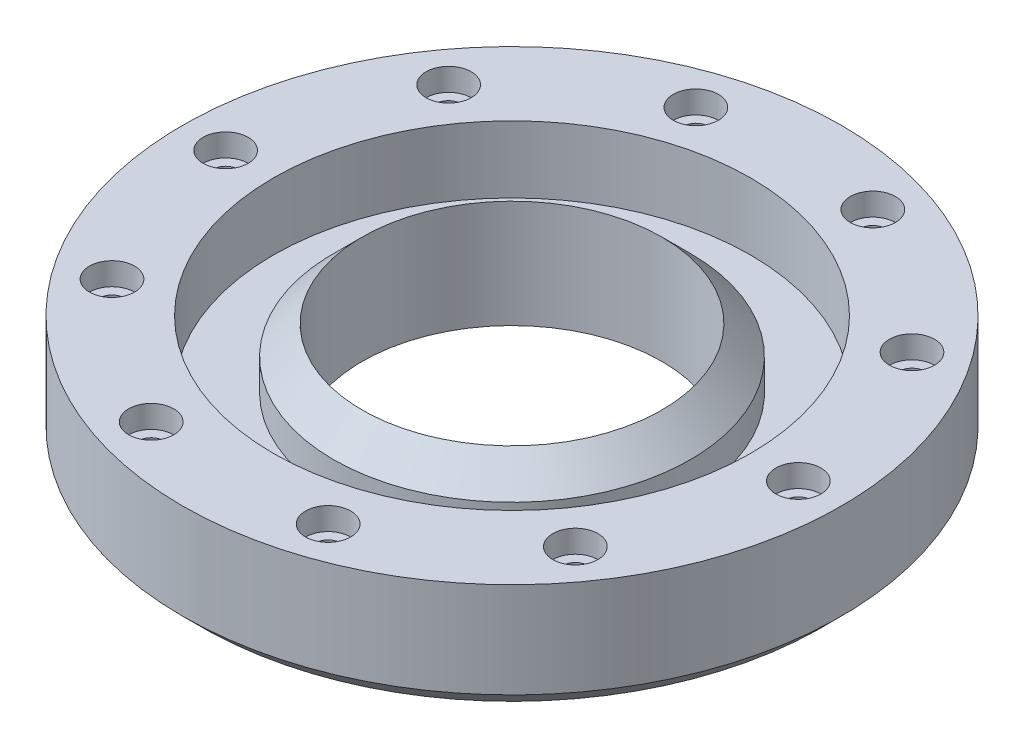
ISO-10303-21;
HEADER;
FILE_DESCRIPTION(('STEP AP214'),'2;1');
FILE_NAME('part.step','',(''),(''),'','','');
FILE_SCHEMA(('AUTOMOTIVE_DESIGN { 1 0 10303 214 1 1 1 1 }'));
ENDSEC;
DATA;
#1=APPLICATION_CONTEXT('core data for automotive mechanical design processes');
#2=APPLICATION_PROTOCOL_DEFINITION('international standard','automotive_design',2000,#1);
#3=PRODUCT_CONTEXT('',#1,'mechanical');
#4=PRODUCT('Part','Part','',(#3));
#5=PRODUCT_RELATED_PRODUCT_CATEGORY('part','',(#4));
#6=PRODUCT_DEFINITION_FORMATION('','',#4);
#7=PRODUCT_DEFINITION_CONTEXT('part definition',#1,'design');
#8=PRODUCT_DEFINITION('design','',#6,#7);
#9=PRODUCT_DEFINITION_SHAPE('','',#8);
#10=(LENGTH_UNIT() NAMED_UNIT(*) SI_UNIT(.MILLI.,.METRE.));
#11=(NAMED_UNIT(*) PLANE_ANGLE_UNIT() SI_UNIT($,.RADIAN.));
#12=(NAMED_UNIT(*) SI_UNIT($,.STERADIAN.) SOLID_ANGLE_UNIT());
#13=UNCERTAINTY_MEASURE_WITH_UNIT(LENGTH_MEASURE(1.E-05),#10,'distance_accuracy_value','');
#14=(GEOMETRIC_REPRESENTATION_CONTEXT(3) GLOBAL_UNCERTAINTY_ASSIGNED_CONTEXT((#13)) GLOBAL_UNIT_ASSIGNED_CONTEXT((#10,
#11,#12)) REPRESENTATION_CONTEXT('',''));
#15=CARTESIAN_POINT('',(0.,0.,0.));
#16=DIRECTION('',(0.,0.,1.));
#17=DIRECTION('',(1.,0.,0.));
#18=AXIS2_PLACEMENT_3D('',#15,#16,#17);
#19=CARTESIAN_POINT('',(0.,0.,0.));
#20=DIRECTION('',(0.,-1.,0.));
#21=DIRECTION('',(0.,0.,-1.));
#22=AXIS2_PLACEMENT_3D('',#19,#20,#21);
#23=CYLINDRICAL_SURFACE('',#22,19.939);
#24=CARTESIAN_POINT('',(0.,0.,0.));
#25=DIRECTION('',(0.,-1.,0.));
#26=DIRECTION('',(0.,0.,-1.));
#27=AXIS2_PLACEMENT_3D('',#24,#25,#26);
#28=CIRCLE('',#27,19.939);
#29=CARTESIAN_POINT('',(0.,0.,-19.939));
#30=VERTEX_POINT('',#29);
#31=EDGE_CURVE('E222',#30,#30,#28,.T.);
#32=ORIENTED_EDGE('',*,*,#31,.T.);
#33=EDGE_LOOP('',(#32));
#34=FACE_BOUND('',#33,.T.);
#35=CARTESIAN_POINT('',(0.,14.33322,0.));
#36=DIRECTION('',(0.,-1.,0.));
#37=DIRECTION('',(0.,0.,-1.));
#38=AXIS2_PLACEMENT_3D('',#35,#36,#37);
#39=CIRCLE('',#38,19.939);
#40=CARTESIAN_POINT('',(0.,14.33322,-19.939));
#41=VERTEX_POINT('',#40);
#42=EDGE_CURVE('E241',#41,#41,#39,.T.);
#43=ORIENTED_EDGE('',*,*,#42,.F.);
#44=EDGE_LOOP('',(#43));
#45=FACE_BOUND('',#44,.T.);
#46=ADVANCED_FACE('F43',(#34,#45),#23,.F.);
#47=CARTESIAN_POINT('',(0.,0.,0.));
#48=DIRECTION('',(0.,-1.,0.));
#49=DIRECTION('',(0.,0.,-1.));
#50=AXIS2_PLACEMENT_3D('',#47,#48,#49);
#51=CYLINDRICAL_SURFACE('',#50,23.749);
#52=CARTESIAN_POINT('',(0.,10.52322,0.));
#53=DIRECTION('',(0.,1.,0.));
#54=DIRECTION('',(0.,0.,1.));
#55=AXIS2_PLACEMENT_3D('',#52,#53,#54);
#56=CIRCLE('',#55,23.749);
#57=CARTESIAN_POINT('',(0.,10.52322,23.749));
#58=VERTEX_POINT('',#57);
#59=EDGE_CURVE('E244',#58,#58,#56,.F.);
#60=ORIENTED_EDGE('',*,*,#59,.T.);
#61=EDGE_LOOP('',(#60));
#62=FACE_BOUND('',#61,.T.);
#63=CARTESIAN_POINT('',(0.,6.35,0.));
#64=DIRECTION('',(0.,-1.,0.));
#65=DIRECTION('',(0.,0.,-1.));
#66=AXIS2_PLACEMENT_3D('',#63,#64,#65);
#67=CIRCLE('',#66,23.749);
#68=CARTESIAN_POINT('',(0.,6.35,-23.749));
#69=VERTEX_POINT('',#68);
#70=EDGE_CURVE('E237',#69,#69,#67,.T.);
#71=ORIENTED_EDGE('',*,*,#70,.F.);
#72=EDGE_LOOP('',(#71));
#73=FACE_BOUND('',#72,.T.);
#74=ADVANCED_FACE('F262',(#62,#73),#51,.T.);
#75=CARTESIAN_POINT('',(23.749,6.35,0.));
#76=DIRECTION('',(0.,1.,0.));
#77=DIRECTION('',(0.,0.,1.));
#78=AXIS2_PLACEMENT_3D('',#75,#76,#77);
#79=PLANE('',#78);
#80=ORIENTED_EDGE('',*,*,#70,.T.);
#81=EDGE_LOOP('',(#80));
#82=FACE_BOUND('',#81,.T.);
#83=CARTESIAN_POINT('',(0.,6.35,0.));
#84=DIRECTION('',(0.,-1.,0.));
#85=DIRECTION('',(0.,0.,-1.));
#86=AXIS2_PLACEMENT_3D('',#83,#84,#85);
#87=CIRCLE('',#86,31.75);
#88=CARTESIAN_POINT('',(0.,6.35,-31.75));
#89=VERTEX_POINT('',#88);
#90=EDGE_CURVE('E233',#89,#89,#87,.T.);
#91=ORIENTED_EDGE('',*,*,#90,.F.);
#92=EDGE_LOOP('',(#91));
#93=FACE_BOUND('',#92,.T.);
#94=ADVANCED_FACE('F268',(#82,#93),#79,.T.);
#95=CARTESIAN_POINT('',(0.,0.,0.));
#96=DIRECTION('',(0.,-1.,0.));
#97=DIRECTION('',(0.,0.,-1.));
#98=AXIS2_PLACEMENT_3D('',#95,#96,#97);
#99=CYLINDRICAL_SURFACE('',#98,31.75);
#100=ORIENTED_EDGE('',*,*,#90,.T.);
#101=EDGE_LOOP('',(#100));
#102=FACE_BOUND('',#101,.T.);
#103=CARTESIAN_POINT('',(0.,15.24,0.));
#104=DIRECTION('',(0.,-1.,0.));
#105=DIRECTION('',(0.,0.,-1.));
#106=AXIS2_PLACEMENT_3D('',#103,#104,#105);
#107=CIRCLE('',#106,31.75);
#108=CARTESIAN_POINT('',(0.,15.24,-31.75));
#109=VERTEX_POINT('',#108);
#110=EDGE_CURVE('E229',#109,#109,#107,.T.);
#111=ORIENTED_EDGE('',*,*,#110,.F.);
#112=EDGE_LOOP('',(#111));
#113=FACE_BOUND('',#112,.T.);
#114=ADVANCED_FACE('F294',(#102,#113),#99,.F.);
#115=CARTESIAN_POINT('',(31.75,15.24,0.));
#116=DIRECTION('',(0.,1.,0.));
#117=DIRECTION('',(0.,0.,1.));
#118=AXIS2_PLACEMENT_3D('',#115,#116,#117);
#119=PLANE('',#118);
#120=CARTESIAN_POINT('',(30.8235474856858,15.24,-22.3946181123428));
#121=DIRECTION('',(0.,1.,0.));
#122=DIRECTION('',(0.,0.,1.));
#123=AXIS2_PLACEMENT_3D('',#120,#121,#122);
#124=CIRCLE('',#123,3.00000000000002);
#125=CARTESIAN_POINT('',(30.8235474856858,15.24,-19.3946181123428));
#126=VERTEX_POINT('',#125);
#127=EDGE_CURVE('E152',#126,#126,#124,.T.);
#128=ORIENTED_EDGE('',*,*,#127,.F.);
#129=EDGE_LOOP('',(#128));
#130=FACE_BOUND('',#129,.T.);
#131=CARTESIAN_POINT('',(11.7735474856859,15.24,-36.2352532708452));
#132=DIRECTION('',(0.,1.,0.));
#133=DIRECTION('',(0.,0.,1.));
#134=AXIS2_PLACEMENT_3D('',#131,#132,#133);
#135=CIRCLE('',#134,3.00000000000001);
#136=CARTESIAN_POINT('',(11.7735474856859,15.24,-33.2352532708452));
#137=VERTEX_POINT('',#136);
#138=EDGE_CURVE('E158',#137,#137,#135,.T.);
#139=ORIENTED_EDGE('',*,*,#138,.F.);
#140=EDGE_LOOP('',(#139));
#141=FACE_BOUND('',#140,.T.);
#142=CARTESIAN_POINT('',(-11.7735474856851,15.24,-36.2352532708455));
#143=DIRECTION('',(0.,1.,0.));
#144=DIRECTION('',(0.,0.,1.));
#145=AXIS2_PLACEMENT_3D('',#142,#143,#144);
#146=CIRCLE('',#145,3.00000000000001);
#147=CARTESIAN_POINT('',(-11.7735474856851,15.24,-33.2352532708454));
#148=VERTEX_POINT('',#147);
#149=EDGE_CURVE('E164',#148,#148,#146,.T.);
#150=ORIENTED_EDGE('',*,*,#149,.F.);
#151=EDGE_LOOP('',(#150));
#152=FACE_BOUND('',#151,.T.);
#153=CARTESIAN_POINT('',(-30.8235474856853,15.24,-22.3946181123435));
#154=DIRECTION('',(0.,1.,0.));
#155=DIRECTION('',(0.,0.,1.));
#156=AXIS2_PLACEMENT_3D('',#153,#154,#155);
#157=CIRCLE('',#156,3.00000000000001);
#158=CARTESIAN_POINT('',(-30.8235474856853,15.24,-19.3946181123435));
#159=VERTEX_POINT('',#158);
#160=EDGE_CURVE('E170',#159,#159,#157,.T.);
#161=ORIENTED_EDGE('',*,*,#160,.F.);
#162=EDGE_LOOP('',(#161));
#163=FACE_BOUND('',#162,.T.);
#164=CARTESIAN_POINT('',(-38.1,15.24,0.));
#165=DIRECTION('',(0.,1.,0.));
#166=DIRECTION('',(0.,0.,1.));
#167=AXIS2_PLACEMENT_3D('',#164,#165,#166);
#168=CIRCLE('',#167,3.00000000000001);
#169=CARTESIAN_POINT('',(-38.1,15.24,3.00000000000001));
#170=VERTEX_POINT('',#169);
#171=EDGE_CURVE('E176',#170,#170,#168,.T.);
#172=ORIENTED_EDGE('',*,*,#171,.F.);
#173=EDGE_LOOP('',(#172));
#174=FACE_BOUND('',#173,.T.);
#175=CARTESIAN_POINT('',(-30.8235474856856,15.24,22.3946181123431));
#176=DIRECTION('',(0.,1.,0.));
#177=DIRECTION('',(0.,0.,1.));
#178=AXIS2_PLACEMENT_3D('',#175,#176,#177);
#179=CIRCLE('',#178,3.00000000000001);
#180=CARTESIAN_POINT('',(-30.8235474856856,15.24,25.3946181123431));
#181=VERTEX_POINT('',#180);
#182=EDGE_CURVE('E184',#181,#181,#179,.T.);
#183=ORIENTED_EDGE('',*,*,#182,.F.);
#184=EDGE_LOOP('',(#183));
#185=FACE_BOUND('',#184,.T.);
#186=CARTESIAN_POINT('',(-11.7735474856857,15.24,36.2352532708453));
#187=DIRECTION('',(0.,1.,0.));
#188=DIRECTION('',(0.,0.,1.));
#189=AXIS2_PLACEMENT_3D('',#186,#187,#188);
#190=CIRCLE('',#189,3.00000000000001);
#191=CARTESIAN_POINT('',(-11.7735474856857,15.24,39.2352532708453));
#192=VERTEX_POINT('',#191);
#193=EDGE_CURVE('E192',#192,#192,#190,.T.);
#194=ORIENTED_EDGE('',*,*,#193,.F.);
#195=EDGE_LOOP('',(#194));
#196=FACE_BOUND('',#195,.T.);
#197=CARTESIAN_POINT('',(11.7735474856854,15.24,36.2352532708454));
#198=DIRECTION('',(0.,1.,0.));
#199=DIRECTION('',(0.,0.,1.));
#200=AXIS2_PLACEMENT_3D('',#197,#198,#199);
#201=CIRCLE('',#200,3.00000000000001);
#202=CARTESIAN_POINT('',(11.7735474856854,15.24,39.2352532708454));
#203=VERTEX_POINT('',#202);
#204=EDGE_CURVE('E198',#203,#203,#201,.T.);
#205=ORIENTED_EDGE('',*,*,#204,.F.);
#206=EDGE_LOOP('',(#205));
#207=FACE_BOUND('',#206,.T.);
#208=CARTESIAN_POINT('',(30.8235474856855,15.24,22.3946181123433));
#209=DIRECTION('',(0.,1.,0.));
#210=DIRECTION('',(0.,0.,1.));
#211=AXIS2_PLACEMENT_3D('',#208,#209,#210);
#212=CIRCLE('',#211,3.00000000000001);
#213=CARTESIAN_POINT('',(30.8235474856855,15.24,25.3946181123433));
#214=VERTEX_POINT('',#213);
#215=EDGE_CURVE('E204',#214,#214,#212,.T.);
#216=ORIENTED_EDGE('',*,*,#215,.F.);
#217=EDGE_LOOP('',(#216));
#218=FACE_BOUND('',#217,.T.);
#219=CARTESIAN_POINT('',(38.1,15.24,0.));
#220=DIRECTION('',(0.,1.,0.));
#221=DIRECTION('',(0.,0.,1.));
#222=AXIS2_PLACEMENT_3D('',#219,#220,#221);
#223=CIRCLE('',#222,3.00000000000001);
#224=CARTESIAN_POINT('',(38.1,15.24,3.00000000000001));
#225=VERTEX_POINT('',#224);
#226=EDGE_CURVE('E216',#225,#225,#223,.T.);
#227=ORIENTED_EDGE('',*,*,#226,.F.);
#228=EDGE_LOOP('',(#227));
#229=FACE_BOUND('',#228,.T.);
#230=ORIENTED_EDGE('',*,*,#110,.T.);
#231=EDGE_LOOP('',(#230));
#232=FACE_BOUND('',#231,.T.);
#233=CARTESIAN_POINT('',(0.,15.24,0.));
#234=DIRECTION('',(0.,-1.,0.));
#235=DIRECTION('',(0.,0.,-1.));
#236=AXIS2_PLACEMENT_3D('',#233,#234,#235);
#237=CIRCLE('',#236,43.84802);
#238=CARTESIAN_POINT('',(0.,15.24,-43.84802));
#239=VERTEX_POINT('',#238);
#240=EDGE_CURVE('E225',#239,#239,#237,.T.);
#241=ORIENTED_EDGE('',*,*,#240,.F.);
#242=EDGE_LOOP('',(#241));
#243=FACE_BOUND('',#242,.T.);
#244=ADVANCED_FACE('F299',(#130,#141,#152,#163,#174,#185,#196,#207,#218,#229,#232,#243),#119,.T.);
#245=CARTESIAN_POINT('',(0.,0.,0.));
#246=DIRECTION('',(0.,-1.,0.));
#247=DIRECTION('',(0.,0.,-1.));
#248=AXIS2_PLACEMENT_3D('',#245,#246,#247);
#249=CYLINDRICAL_SURFACE('',#248,43.84802);
#250=CARTESIAN_POINT('',(0.,2.54000000000001,0.));
#251=DIRECTION('',(0.,-1.,0.));
#252=DIRECTION('',(0.,0.,-1.));
#253=AXIS2_PLACEMENT_3D('',#250,#251,#252);
#254=CIRCLE('',#253,43.84802);
#255=CARTESIAN_POINT('',(0.,2.54000000000001,-43.84802));
#256=VERTEX_POINT('',#255);
#257=EDGE_CURVE('E11',#256,#256,#254,.F.);
#258=ORIENTED_EDGE('',*,*,#257,.T.);
#259=EDGE_LOOP('',(#258));
#260=FACE_BOUND('',#259,.T.);
#261=ORIENTED_EDGE('',*,*,#240,.T.);
#262=EDGE_LOOP('',(#261));
#263=FACE_BOUND('',#262,.T.);
#264=ADVANCED_FACE('F284',(#260,#263),#249,.T.);
#265=CARTESIAN_POINT('',(19.939,0.,0.));
#266=DIRECTION('',(0.,-1.,0.));
#267=DIRECTION('',(0.,0.,-1.));
#268=AXIS2_PLACEMENT_3D('',#265,#266,#267);
#269=PLANE('',#268);
#270=CARTESIAN_POINT('',(0.,0.,0.));
#271=DIRECTION('',(0.,-1.,0.));
#272=DIRECTION('',(0.,0.,-1.));
#273=AXIS2_PLACEMENT_3D('',#270,#271,#272);
#274=CIRCLE('',#273,41.30802);
#275=CARTESIAN_POINT('',(0.,0.,-41.30802));
#276=VERTEX_POINT('',#275);
#277=EDGE_CURVE('E52',#276,#276,#274,.T.);
#278=ORIENTED_EDGE('',*,*,#277,.T.);
#279=EDGE_LOOP('',(#278));
#280=FACE_BOUND('',#279,.T.);
#281=ORIENTED_EDGE('',*,*,#31,.F.);
#282=EDGE_LOOP('',(#281));
#283=FACE_BOUND('',#282,.T.);
#284=ADVANCED_FACE('F251',(#280,#283),#269,.T.);
#285=CARTESIAN_POINT('',(0.,10.52322,0.));
#286=DIRECTION('',(0.,-1.,0.));
#287=DIRECTION('',(0.,0.,-1.));
#288=AXIS2_PLACEMENT_3D('',#285,#286,#287);
#289=CONICAL_SURFACE('',#288,23.749,0.785398163397451);
#290=ORIENTED_EDGE('',*,*,#42,.T.);
#291=EDGE_LOOP('',(#290));
#292=FACE_BOUND('',#291,.T.);
#293=ORIENTED_EDGE('',*,*,#59,.F.);
#294=EDGE_LOOP('',(#293));
#295=FACE_BOUND('',#294,.T.);
#296=ADVANCED_FACE('F273',(#292,#295),#289,.T.);
#297=CARTESIAN_POINT('',(38.1,12.24,0.));
#298=DIRECTION('',(0.,-1.,0.));
#299=DIRECTION('',(0.,0.,-1.));
#300=AXIS2_PLACEMENT_3D('',#297,#298,#299);
#301=PLANE('',#300);
#302=CARTESIAN_POINT('',(38.1,12.24,0.));
#303=DIRECTION('',(0.,1.,0.));
#304=DIRECTION('',(0.,0.,1.));
#305=AXIS2_PLACEMENT_3D('',#302,#303,#304);
#306=CIRCLE('',#305,1.65);
#307=CARTESIAN_POINT('',(38.1,12.24,1.65));
#308=VERTEX_POINT('',#307);
#309=EDGE_CURVE('E210',#308,#308,#306,.T.);
#310=ORIENTED_EDGE('',*,*,#309,.F.);
#311=EDGE_LOOP('',(#310));
#312=FACE_BOUND('',#311,.T.);
#313=CARTESIAN_POINT('',(38.1,12.24,0.));
#314=DIRECTION('',(0.,1.,0.));
#315=DIRECTION('',(0.,0.,1.));
#316=AXIS2_PLACEMENT_3D('',#313,#314,#315);
#317=CIRCLE('',#316,3.00000000000002);
#318=CARTESIAN_POINT('',(38.1,12.24,3.00000000000002));
#319=VERTEX_POINT('',#318);
#320=EDGE_CURVE('E219',#319,#319,#317,.T.);
#321=ORIENTED_EDGE('',*,*,#320,.T.);
#322=EDGE_LOOP('',(#321));
#323=FACE_BOUND('',#322,.T.);
#324=ADVANCED_FACE('F275',(#312,#323),#301,.F.);
#325=CARTESIAN_POINT('',(38.1,15.24,0.));
#326=DIRECTION('',(0.,1.,0.));
#327=DIRECTION('',(0.,0.,1.));
#328=AXIS2_PLACEMENT_3D('',#325,#326,#327);
#329=CYLINDRICAL_SURFACE('',#328,3.00000000000001);
#330=ORIENTED_EDGE('',*,*,#320,.F.);
#331=EDGE_LOOP('',(#330));
#332=FACE_BOUND('',#331,.T.);
#333=ORIENTED_EDGE('',*,*,#226,.T.);
#334=EDGE_LOOP('',(#333));
#335=FACE_BOUND('',#334,.T.);
#336=ADVANCED_FACE('F281',(#332,#335),#329,.F.);
#337=CARTESIAN_POINT('',(38.1,4.2399906,0.));
#338=DIRECTION('',(0.,1.,0.));
#339=DIRECTION('',(0.,0.,1.));
#340=AXIS2_PLACEMENT_3D('',#337,#338,#339);
#341=CONICAL_SURFACE('',#340,1.65,1.02974425867665);
#342=CARTESIAN_POINT('',(38.1,3.24857057860452,0.));
#343=VERTEX_POINT('',#342);
#344=VERTEX_LOOP('',#343);
#345=FACE_BOUND('',#344,.T.);
#346=CARTESIAN_POINT('',(38.1,4.2399906,0.));
#347=DIRECTION('',(0.,1.,0.));
#348=DIRECTION('',(0.,0.,1.));
#349=AXIS2_PLACEMENT_3D('',#346,#347,#348);
#350=CIRCLE('',#349,1.65);
#351=CARTESIAN_POINT('',(38.1,4.2399906,1.65));
#352=VERTEX_POINT('',#351);
#353=EDGE_CURVE('E213',#352,#352,#350,.T.);
#354=ORIENTED_EDGE('',*,*,#353,.T.);
#355=EDGE_LOOP('',(#354));
#356=FACE_BOUND('',#355,.T.);
#357=ADVANCED_FACE('F317',(#345,#356),#341,.F.);
#358=CARTESIAN_POINT('',(38.1,12.24,0.));
#359=DIRECTION('',(0.,1.,0.));
#360=DIRECTION('',(0.,0.,1.));
#361=AXIS2_PLACEMENT_3D('',#358,#359,#360);
#362=CYLINDRICAL_SURFACE('',#361,1.65);
#363=ORIENTED_EDGE('',*,*,#353,.F.);
#364=EDGE_LOOP('',(#363));
#365=FACE_BOUND('',#364,.T.);
#366=ORIENTED_EDGE('',*,*,#309,.T.);
#367=EDGE_LOOP('',(#366));
#368=FACE_BOUND('',#367,.T.);
#369=ADVANCED_FACE('F321',(#365,#368),#362,.F.);
#370=CARTESIAN_POINT('',(30.8235474856855,12.24,22.3946181123433));
#371=DIRECTION('',(0.,-1.,0.));
#372=DIRECTION('',(0.,0.,-1.));
#373=AXIS2_PLACEMENT_3D('',#370,#371,#372);
#374=PLANE('',#373);
#375=CARTESIAN_POINT('',(30.8235474856855,12.24,22.3946181123433));
#376=DIRECTION('',(0.,1.,0.));
#377=DIRECTION('',(0.,0.,1.));
#378=AXIS2_PLACEMENT_3D('',#375,#376,#377);
#379=CIRCLE('',#378,1.65);
#380=CARTESIAN_POINT('',(30.8235474856855,12.24,24.0446181123433));
#381=VERTEX_POINT('',#380);
#382=EDGE_CURVE('E146',#381,#381,#379,.T.);
#383=ORIENTED_EDGE('',*,*,#382,.F.);
#384=EDGE_LOOP('',(#383));
#385=FACE_BOUND('',#384,.T.);
#386=CARTESIAN_POINT('',(30.8235474856855,12.24,22.3946181123433));
#387=DIRECTION('',(0.,1.,0.));
#388=DIRECTION('',(0.,0.,1.));
#389=AXIS2_PLACEMENT_3D('',#386,#387,#388);
#390=CIRCLE('',#389,3.00000000000001);
#391=CARTESIAN_POINT('',(30.8235474856855,12.24,25.3946181123433));
#392=VERTEX_POINT('',#391);
#393=EDGE_CURVE('E207',#392,#392,#390,.T.);
#394=ORIENTED_EDGE('',*,*,#393,.T.);
#395=EDGE_LOOP('',(#394));
#396=FACE_BOUND('',#395,.T.);
#397=ADVANCED_FACE('F324',(#385,#396),#374,.F.);
#398=CARTESIAN_POINT('',(30.8235474856855,15.24,22.3946181123433));
#399=DIRECTION('',(0.,1.,0.));
#400=DIRECTION('',(0.,0.,1.));
#401=AXIS2_PLACEMENT_3D('',#398,#399,#400);
#402=CYLINDRICAL_SURFACE('',#401,3.00000000000001);
#403=ORIENTED_EDGE('',*,*,#393,.F.);
#404=EDGE_LOOP('',(#403));
#405=FACE_BOUND('',#404,.T.);
#406=ORIENTED_EDGE('',*,*,#215,.T.);
#407=EDGE_LOOP('',(#406));
#408=FACE_BOUND('',#407,.T.);
#409=ADVANCED_FACE('F328',(#405,#408),#402,.F.);
#410=CARTESIAN_POINT('',(11.7735474856854,12.24,36.2352532708454));
#411=DIRECTION('',(0.,-1.,0.));
#412=DIRECTION('',(0.,0.,-1.));
#413=AXIS2_PLACEMENT_3D('',#410,#411,#412);
#414=PLANE('',#413);
#415=CARTESIAN_POINT('',(11.7735474856854,12.24,36.2352532708454));
#416=DIRECTION('',(0.,1.,0.));
#417=DIRECTION('',(0.,0.,1.));
#418=AXIS2_PLACEMENT_3D('',#415,#416,#417);
#419=CIRCLE('',#418,1.65);
#420=CARTESIAN_POINT('',(11.7735474856854,12.24,37.8852532708454));
#421=VERTEX_POINT('',#420);
#422=EDGE_CURVE('E140',#421,#421,#419,.T.);
#423=ORIENTED_EDGE('',*,*,#422,.F.);
#424=EDGE_LOOP('',(#423));
#425=FACE_BOUND('',#424,.T.);
#426=CARTESIAN_POINT('',(11.7735474856854,12.24,36.2352532708454));
#427=DIRECTION('',(0.,1.,0.));
#428=DIRECTION('',(0.,0.,1.));
#429=AXIS2_PLACEMENT_3D('',#426,#427,#428);
#430=CIRCLE('',#429,3.00000000000001);
#431=CARTESIAN_POINT('',(11.7735474856854,12.24,39.2352532708454));
#432=VERTEX_POINT('',#431);
#433=EDGE_CURVE('E201',#432,#432,#430,.T.);
#434=ORIENTED_EDGE('',*,*,#433,.T.);
#435=EDGE_LOOP('',(#434));
#436=FACE_BOUND('',#435,.T.);
#437=ADVANCED_FACE('F332',(#425,#436),#414,.F.);
#438=CARTESIAN_POINT('',(11.7735474856854,15.24,36.2352532708454));
#439=DIRECTION('',(0.,1.,0.));
#440=DIRECTION('',(0.,0.,1.));
#441=AXIS2_PLACEMENT_3D('',#438,#439,#440);
#442=CYLINDRICAL_SURFACE('',#441,3.00000000000001);
#443=ORIENTED_EDGE('',*,*,#433,.F.);
#444=EDGE_LOOP('',(#443));
#445=FACE_BOUND('',#444,.T.);
#446=ORIENTED_EDGE('',*,*,#204,.T.);
#447=EDGE_LOOP('',(#446));
#448=FACE_BOUND('',#447,.T.);
#449=ADVANCED_FACE('F336',(#445,#448),#442,.F.);
#450=CARTESIAN_POINT('',(-11.7735474856857,12.24,36.2352532708453));
#451=DIRECTION('',(0.,-1.,0.));
#452=DIRECTION('',(0.,0.,-1.));
#453=AXIS2_PLACEMENT_3D('',#450,#451,#452);
#454=PLANE('',#453);
#455=CARTESIAN_POINT('',(-11.7735474856857,12.24,36.2352532708453));
#456=DIRECTION('',(0.,1.,0.));
#457=DIRECTION('',(0.,0.,1.));
#458=AXIS2_PLACEMENT_3D('',#455,#456,#457);
#459=CIRCLE('',#458,1.65);
#460=CARTESIAN_POINT('',(-11.7735474856857,12.24,37.8852532708453));
#461=VERTEX_POINT('',#460);
#462=EDGE_CURVE('E134',#461,#461,#459,.T.);
#463=ORIENTED_EDGE('',*,*,#462,.F.);
#464=EDGE_LOOP('',(#463));
#465=FACE_BOUND('',#464,.T.);
#466=CARTESIAN_POINT('',(-11.7735474856857,12.24,36.2352532708453));
#467=DIRECTION('',(0.,1.,0.));
#468=DIRECTION('',(0.,0.,1.));
#469=AXIS2_PLACEMENT_3D('',#466,#467,#468);
#470=CIRCLE('',#469,3.00000000000001);
#471=CARTESIAN_POINT('',(-11.7735474856857,12.24,39.2352532708453));
#472=VERTEX_POINT('',#471);
#473=EDGE_CURVE('E195',#472,#472,#470,.T.);
#474=ORIENTED_EDGE('',*,*,#473,.T.);
#475=EDGE_LOOP('',(#474));
#476=FACE_BOUND('',#475,.T.);
#477=ADVANCED_FACE('F340',(#465,#476),#454,.F.);
#478=CARTESIAN_POINT('',(-11.7735474856857,15.24,36.2352532708453));
#479=DIRECTION('',(0.,1.,0.));
#480=DIRECTION('',(0.,0.,1.));
#481=AXIS2_PLACEMENT_3D('',#478,#479,#480);
#482=CYLINDRICAL_SURFACE('',#481,3.00000000000001);
#483=ORIENTED_EDGE('',*,*,#473,.F.);
#484=EDGE_LOOP('',(#483));
#485=FACE_BOUND('',#484,.T.);
#486=ORIENTED_EDGE('',*,*,#193,.T.);
#487=EDGE_LOOP('',(#486));
#488=FACE_BOUND('',#487,.T.);
#489=ADVANCED_FACE('F344',(#485,#488),#482,.F.);
#490=CARTESIAN_POINT('',(-30.8235474856856,12.24,22.3946181123431));
#491=DIRECTION('',(0.,-1.,0.));
#492=DIRECTION('',(0.,0.,-1.));
#493=AXIS2_PLACEMENT_3D('',#490,#491,#492);
#494=PLANE('',#493);
#495=CARTESIAN_POINT('',(-30.8235474856856,12.24,22.3946181123431));
#496=DIRECTION('',(0.,1.,0.));
#497=DIRECTION('',(0.,0.,1.));
#498=AXIS2_PLACEMENT_3D('',#495,#496,#497);
#499=CIRCLE('',#498,1.65);
#500=CARTESIAN_POINT('',(-30.8235474856856,12.24,24.0446181123431));
#501=VERTEX_POINT('',#500);
#502=EDGE_CURVE('E127',#501,#501,#499,.T.);
#503=ORIENTED_EDGE('',*,*,#502,.F.);
#504=EDGE_LOOP('',(#503));
#505=FACE_BOUND('',#504,.T.);
#506=CARTESIAN_POINT('',(-30.8235474856856,12.24,22.3946181123431));
#507=DIRECTION('',(0.,1.,0.));
#508=DIRECTION('',(0.,0.,1.));
#509=AXIS2_PLACEMENT_3D('',#506,#507,#508);
#510=CIRCLE('',#509,3.00000000000001);
#511=CARTESIAN_POINT('',(-30.8235474856856,12.24,25.3946181123431));
#512=VERTEX_POINT('',#511);
#513=EDGE_CURVE('E188',#512,#512,#510,.T.);
#514=ORIENTED_EDGE('',*,*,#513,.T.);
#515=EDGE_LOOP('',(#514));
#516=FACE_BOUND('',#515,.T.);
#517=ADVANCED_FACE('F348',(#505,#516),#494,.F.);
#518=CARTESIAN_POINT('',(-30.8235474856856,15.24,22.3946181123431));
#519=DIRECTION('',(0.,1.,0.));
#520=DIRECTION('',(0.,0.,1.));
#521=AXIS2_PLACEMENT_3D('',#518,#519,#520);
#522=CYLINDRICAL_SURFACE('',#521,3.00000000000001);
#523=ORIENTED_EDGE('',*,*,#513,.F.);
#524=EDGE_LOOP('',(#523));
#525=FACE_BOUND('',#524,.T.);
#526=ORIENTED_EDGE('',*,*,#182,.T.);
#527=EDGE_LOOP('',(#526));
#528=FACE_BOUND('',#527,.T.);
#529=ADVANCED_FACE('F352',(#525,#528),#522,.F.);
#530=CARTESIAN_POINT('',(-38.1,12.24,0.));
#531=DIRECTION('',(0.,-1.,0.));
#532=DIRECTION('',(0.,0.,-1.));
#533=AXIS2_PLACEMENT_3D('',#530,#531,#532);
#534=PLANE('',#533);
#535=CARTESIAN_POINT('',(-38.1,12.24,0.));
#536=DIRECTION('',(0.,1.,0.));
#537=DIRECTION('',(0.,0.,1.));
#538=AXIS2_PLACEMENT_3D('',#535,#536,#537);
#539=CIRCLE('',#538,1.65);
#540=CARTESIAN_POINT('',(-38.1,12.24,1.65));
#541=VERTEX_POINT('',#540);
#542=EDGE_CURVE('E119',#541,#541,#539,.T.);
#543=ORIENTED_EDGE('',*,*,#542,.F.);
#544=EDGE_LOOP('',(#543));
#545=FACE_BOUND('',#544,.T.);
#546=CARTESIAN_POINT('',(-38.1,12.24,0.));
#547=DIRECTION('',(0.,1.,0.));
#548=DIRECTION('',(0.,0.,1.));
#549=AXIS2_PLACEMENT_3D('',#546,#547,#548);
#550=CIRCLE('',#549,3.00000000000002);
#551=CARTESIAN_POINT('',(-38.1,12.24,3.00000000000002));
#552=VERTEX_POINT('',#551);
#553=EDGE_CURVE('E180',#552,#552,#550,.T.);
#554=ORIENTED_EDGE('',*,*,#553,.T.);
#555=EDGE_LOOP('',(#554));
#556=FACE_BOUND('',#555,.T.);
#557=ADVANCED_FACE('F356',(#545,#556),#534,.F.);
#558=CARTESIAN_POINT('',(-38.1,15.24,0.));
#559=DIRECTION('',(0.,1.,0.));
#560=DIRECTION('',(0.,0.,1.));
#561=AXIS2_PLACEMENT_3D('',#558,#559,#560);
#562=CYLINDRICAL_SURFACE('',#561,3.00000000000001);
#563=ORIENTED_EDGE('',*,*,#553,.F.);
#564=EDGE_LOOP('',(#563));
#565=FACE_BOUND('',#564,.T.);
#566=ORIENTED_EDGE('',*,*,#171,.T.);
#567=EDGE_LOOP('',(#566));
#568=FACE_BOUND('',#567,.T.);
#569=ADVANCED_FACE('F360',(#565,#568),#562,.F.);
#570=CARTESIAN_POINT('',(-30.8235474856853,12.24,-22.3946181123435));
#571=DIRECTION('',(0.,-1.,0.));
#572=DIRECTION('',(0.,0.,-1.));
#573=AXIS2_PLACEMENT_3D('',#570,#571,#572);
#574=PLANE('',#573);
#575=CARTESIAN_POINT('',(-30.8235474856853,12.24,-22.3946181123435));
#576=DIRECTION('',(0.,1.,0.));
#577=DIRECTION('',(0.,0.,1.));
#578=AXIS2_PLACEMENT_3D('',#575,#576,#577);
#579=CIRCLE('',#578,1.65);
#580=CARTESIAN_POINT('',(-30.8235474856853,12.24,-20.7446181123435));
#581=VERTEX_POINT('',#580);
#582=EDGE_CURVE('E112',#581,#581,#579,.T.);
#583=ORIENTED_EDGE('',*,*,#582,.F.);
#584=EDGE_LOOP('',(#583));
#585=FACE_BOUND('',#584,.T.);
#586=CARTESIAN_POINT('',(-30.8235474856853,12.24,-22.3946181123435));
#587=DIRECTION('',(0.,1.,0.));
#588=DIRECTION('',(0.,0.,1.));
#589=AXIS2_PLACEMENT_3D('',#586,#587,#588);
#590=CIRCLE('',#589,3.00000000000001);
#591=CARTESIAN_POINT('',(-30.8235474856853,12.24,-19.3946181123435));
#592=VERTEX_POINT('',#591);
#593=EDGE_CURVE('E173',#592,#592,#590,.T.);
#594=ORIENTED_EDGE('',*,*,#593,.T.);
#595=EDGE_LOOP('',(#594));
#596=FACE_BOUND('',#595,.T.);
#597=ADVANCED_FACE('F364',(#585,#596),#574,.F.);
#598=CARTESIAN_POINT('',(-30.8235474856853,15.24,-22.3946181123435));
#599=DIRECTION('',(0.,1.,0.));
#600=DIRECTION('',(0.,0.,1.));
#601=AXIS2_PLACEMENT_3D('',#598,#599,#600);
#602=CYLINDRICAL_SURFACE('',#601,3.00000000000001);
#603=ORIENTED_EDGE('',*,*,#593,.F.);
#604=EDGE_LOOP('',(#603));
#605=FACE_BOUND('',#604,.T.);
#606=ORIENTED_EDGE('',*,*,#160,.T.);
#607=EDGE_LOOP('',(#606));
#608=FACE_BOUND('',#607,.T.);
#609=ADVANCED_FACE('F368',(#605,#608),#602,.F.);
#610=CARTESIAN_POINT('',(-11.7735474856851,12.24,-36.2352532708455));
#611=DIRECTION('',(0.,-1.,0.));
#612=DIRECTION('',(0.,0.,-1.));
#613=AXIS2_PLACEMENT_3D('',#610,#611,#612);
#614=PLANE('',#613);
#615=CARTESIAN_POINT('',(-11.7735474856851,12.24,-36.2352532708455));
#616=DIRECTION('',(0.,1.,0.));
#617=DIRECTION('',(0.,0.,1.));
#618=AXIS2_PLACEMENT_3D('',#615,#616,#617);
#619=CIRCLE('',#618,1.65);
#620=CARTESIAN_POINT('',(-11.7735474856851,12.24,-34.5852532708455));
#621=VERTEX_POINT('',#620);
#622=EDGE_CURVE('E106',#621,#621,#619,.T.);
#623=ORIENTED_EDGE('',*,*,#622,.F.);
#624=EDGE_LOOP('',(#623));
#625=FACE_BOUND('',#624,.T.);
#626=CARTESIAN_POINT('',(-11.7735474856851,12.24,-36.2352532708455));
#627=DIRECTION('',(0.,1.,0.));
#628=DIRECTION('',(0.,0.,1.));
#629=AXIS2_PLACEMENT_3D('',#626,#627,#628);
#630=CIRCLE('',#629,3.00000000000001);
#631=CARTESIAN_POINT('',(-11.7735474856851,12.24,-33.2352532708454));
#632=VERTEX_POINT('',#631);
#633=EDGE_CURVE('E167',#632,#632,#630,.T.);
#634=ORIENTED_EDGE('',*,*,#633,.T.);
#635=EDGE_LOOP('',(#634));
#636=FACE_BOUND('',#635,.T.);
#637=ADVANCED_FACE('F372',(#625,#636),#614,.F.);
#638=CARTESIAN_POINT('',(-11.7735474856851,15.24,-36.2352532708455));
#639=DIRECTION('',(0.,1.,0.));
#640=DIRECTION('',(0.,0.,1.));
#641=AXIS2_PLACEMENT_3D('',#638,#639,#640);
#642=CYLINDRICAL_SURFACE('',#641,3.00000000000001);
#643=ORIENTED_EDGE('',*,*,#633,.F.);
#644=EDGE_LOOP('',(#643));
#645=FACE_BOUND('',#644,.T.);
#646=ORIENTED_EDGE('',*,*,#149,.T.);
#647=EDGE_LOOP('',(#646));
#648=FACE_BOUND('',#647,.T.);
#649=ADVANCED_FACE('F376',(#645,#648),#642,.F.);
#650=CARTESIAN_POINT('',(11.7735474856859,12.24,-36.2352532708452));
#651=DIRECTION('',(0.,-1.,0.));
#652=DIRECTION('',(0.,0.,-1.));
#653=AXIS2_PLACEMENT_3D('',#650,#651,#652);
#654=PLANE('',#653);
#655=CARTESIAN_POINT('',(11.7735474856859,12.24,-36.2352532708452));
#656=DIRECTION('',(0.,1.,0.));
#657=DIRECTION('',(0.,0.,1.));
#658=AXIS2_PLACEMENT_3D('',#655,#656,#657);
#659=CIRCLE('',#658,1.65);
#660=CARTESIAN_POINT('',(11.7735474856859,12.24,-34.5852532708452));
#661=VERTEX_POINT('',#660);
#662=EDGE_CURVE('E95',#661,#661,#659,.T.);
#663=ORIENTED_EDGE('',*,*,#662,.F.);
#664=EDGE_LOOP('',(#663));
#665=FACE_BOUND('',#664,.T.);
#666=CARTESIAN_POINT('',(11.7735474856859,12.24,-36.2352532708452));
#667=DIRECTION('',(0.,1.,0.));
#668=DIRECTION('',(0.,0.,1.));
#669=AXIS2_PLACEMENT_3D('',#666,#667,#668);
#670=CIRCLE('',#669,3.00000000000001);
#671=CARTESIAN_POINT('',(11.7735474856859,12.24,-33.2352532708452));
#672=VERTEX_POINT('',#671);
#673=EDGE_CURVE('E161',#672,#672,#670,.T.);
#674=ORIENTED_EDGE('',*,*,#673,.T.);
#675=EDGE_LOOP('',(#674));
#676=FACE_BOUND('',#675,.T.);
#677=ADVANCED_FACE('F380',(#665,#676),#654,.F.);
#678=CARTESIAN_POINT('',(11.7735474856859,15.24,-36.2352532708452));
#679=DIRECTION('',(0.,1.,0.));
#680=DIRECTION('',(0.,0.,1.));
#681=AXIS2_PLACEMENT_3D('',#678,#679,#680);
#682=CYLINDRICAL_SURFACE('',#681,3.00000000000001);
#683=ORIENTED_EDGE('',*,*,#673,.F.);
#684=EDGE_LOOP('',(#683));
#685=FACE_BOUND('',#684,.T.);
#686=ORIENTED_EDGE('',*,*,#138,.T.);
#687=EDGE_LOOP('',(#686));
#688=FACE_BOUND('',#687,.T.);
#689=ADVANCED_FACE('F384',(#685,#688),#682,.F.);
#690=CARTESIAN_POINT('',(30.8235474856858,12.24,-22.3946181123428));
#691=DIRECTION('',(0.,-1.,0.));
#692=DIRECTION('',(0.,0.,-1.));
#693=AXIS2_PLACEMENT_3D('',#690,#691,#692);
#694=PLANE('',#693);
#695=CARTESIAN_POINT('',(30.8235474856858,12.24,-22.3946181123428));
#696=DIRECTION('',(0.,1.,0.));
#697=DIRECTION('',(0.,0.,1.));
#698=AXIS2_PLACEMENT_3D('',#695,#696,#697);
#699=CIRCLE('',#698,1.65);
#700=CARTESIAN_POINT('',(30.8235474856858,12.24,-20.7446181123428));
#701=VERTEX_POINT('',#700);
#702=EDGE_CURVE('E96',#701,#701,#699,.T.);
#703=ORIENTED_EDGE('',*,*,#702,.F.);
#704=EDGE_LOOP('',(#703));
#705=FACE_BOUND('',#704,.T.);
#706=CARTESIAN_POINT('',(30.8235474856858,12.24,-22.3946181123428));
#707=DIRECTION('',(0.,1.,0.));
#708=DIRECTION('',(0.,0.,1.));
#709=AXIS2_PLACEMENT_3D('',#706,#707,#708);
#710=CIRCLE('',#709,3.00000000000002);
#711=CARTESIAN_POINT('',(30.8235474856858,12.24,-19.3946181123428));
#712=VERTEX_POINT('',#711);
#713=EDGE_CURVE('E155',#712,#712,#710,.T.);
#714=ORIENTED_EDGE('',*,*,#713,.T.);
#715=EDGE_LOOP('',(#714));
#716=FACE_BOUND('',#715,.T.);
#717=ADVANCED_FACE('F388',(#705,#716),#694,.F.);
#718=CARTESIAN_POINT('',(30.8235474856858,15.24,-22.3946181123428));
#719=DIRECTION('',(0.,1.,0.));
#720=DIRECTION('',(0.,0.,1.));
#721=AXIS2_PLACEMENT_3D('',#718,#719,#720);
#722=CYLINDRICAL_SURFACE('',#721,3.00000000000002);
#723=ORIENTED_EDGE('',*,*,#713,.F.);
#724=EDGE_LOOP('',(#723));
#725=FACE_BOUND('',#724,.T.);
#726=ORIENTED_EDGE('',*,*,#127,.T.);
#727=EDGE_LOOP('',(#726));
#728=FACE_BOUND('',#727,.T.);
#729=ADVANCED_FACE('F392',(#725,#728),#722,.F.);
#730=CARTESIAN_POINT('',(30.8235474856855,4.2399906,22.3946181123433));
#731=DIRECTION('',(0.,1.,0.));
#732=DIRECTION('',(0.,0.,1.));
#733=AXIS2_PLACEMENT_3D('',#730,#731,#732);
#734=CONICAL_SURFACE('',#733,1.65,1.02974425867665);
#735=CARTESIAN_POINT('',(30.8235474856855,3.24857057860452,22.3946181123433));
#736=VERTEX_POINT('',#735);
#737=VERTEX_LOOP('',#736);
#738=FACE_BOUND('',#737,.T.);
#739=CARTESIAN_POINT('',(30.8235474856855,4.2399906,22.3946181123433));
#740=DIRECTION('',(0.,1.,0.));
#741=DIRECTION('',(0.,0.,1.));
#742=AXIS2_PLACEMENT_3D('',#739,#740,#741);
#743=CIRCLE('',#742,1.65);
#744=CARTESIAN_POINT('',(30.8235474856855,4.2399906,24.0446181123433));
#745=VERTEX_POINT('',#744);
#746=EDGE_CURVE('E149',#745,#745,#743,.T.);
#747=ORIENTED_EDGE('',*,*,#746,.T.);
#748=EDGE_LOOP('',(#747));
#749=FACE_BOUND('',#748,.T.);
#750=ADVANCED_FACE('F396',(#738,#749),#734,.F.);
#751=CARTESIAN_POINT('',(30.8235474856855,12.24,22.3946181123433));
#752=DIRECTION('',(0.,1.,0.));
#753=DIRECTION('',(0.,0.,1.));
#754=AXIS2_PLACEMENT_3D('',#751,#752,#753);
#755=CYLINDRICAL_SURFACE('',#754,1.65);
#756=ORIENTED_EDGE('',*,*,#746,.F.);
#757=EDGE_LOOP('',(#756));
#758=FACE_BOUND('',#757,.T.);
#759=ORIENTED_EDGE('',*,*,#382,.T.);
#760=EDGE_LOOP('',(#759));
#761=FACE_BOUND('',#760,.T.);
#762=ADVANCED_FACE('F400',(#758,#761),#755,.F.);
#763=CARTESIAN_POINT('',(11.7735474856854,4.2399906,36.2352532708454));
#764=DIRECTION('',(0.,1.,0.));
#765=DIRECTION('',(0.,0.,1.));
#766=AXIS2_PLACEMENT_3D('',#763,#764,#765);
#767=CONICAL_SURFACE('',#766,1.65,1.02974425867665);
#768=CARTESIAN_POINT('',(11.7735474856854,3.24857057860452,36.2352532708454));
#769=VERTEX_POINT('',#768);
#770=VERTEX_LOOP('',#769);
#771=FACE_BOUND('',#770,.T.);
#772=CARTESIAN_POINT('',(11.7735474856854,4.2399906,36.2352532708454));
#773=DIRECTION('',(0.,1.,0.));
#774=DIRECTION('',(0.,0.,1.));
#775=AXIS2_PLACEMENT_3D('',#772,#773,#774);
#776=CIRCLE('',#775,1.65);
#777=CARTESIAN_POINT('',(11.7735474856854,4.2399906,37.8852532708454));
#778=VERTEX_POINT('',#777);
#779=EDGE_CURVE('E143',#778,#778,#776,.T.);
#780=ORIENTED_EDGE('',*,*,#779,.T.);
#781=EDGE_LOOP('',(#780));
#782=FACE_BOUND('',#781,.T.);
#783=ADVANCED_FACE('F403',(#771,#782),#767,.F.);
#784=CARTESIAN_POINT('',(11.7735474856854,12.24,36.2352532708454));
#785=DIRECTION('',(0.,1.,0.));
#786=DIRECTION('',(0.,0.,1.));
#787=AXIS2_PLACEMENT_3D('',#784,#785,#786);
#788=CYLINDRICAL_SURFACE('',#787,1.65);
#789=ORIENTED_EDGE('',*,*,#779,.F.);
#790=EDGE_LOOP('',(#789));
#791=FACE_BOUND('',#790,.T.);
#792=ORIENTED_EDGE('',*,*,#422,.T.);
#793=EDGE_LOOP('',(#792));
#794=FACE_BOUND('',#793,.T.);
#795=ADVANCED_FACE('F407',(#791,#794),#788,.F.);
#796=CARTESIAN_POINT('',(-11.7735474856857,4.2399906,36.2352532708453));
#797=DIRECTION('',(0.,1.,0.));
#798=DIRECTION('',(0.,0.,1.));
#799=AXIS2_PLACEMENT_3D('',#796,#797,#798);
#800=CONICAL_SURFACE('',#799,1.65,1.02974425867665);
#801=CARTESIAN_POINT('',(-11.7735474856857,3.24857057860452,36.2352532708453));
#802=VERTEX_POINT('',#801);
#803=VERTEX_LOOP('',#802);
#804=FACE_BOUND('',#803,.T.);
#805=CARTESIAN_POINT('',(-11.7735474856857,4.2399906,36.2352532708453));
#806=DIRECTION('',(0.,1.,0.));
#807=DIRECTION('',(0.,0.,1.));
#808=AXIS2_PLACEMENT_3D('',#805,#806,#807);
#809=CIRCLE('',#808,1.65);
#810=CARTESIAN_POINT('',(-11.7735474856857,4.2399906,37.8852532708453));
#811=VERTEX_POINT('',#810);
#812=EDGE_CURVE('E137',#811,#811,#809,.T.);
#813=ORIENTED_EDGE('',*,*,#812,.T.);
#814=EDGE_LOOP('',(#813));
#815=FACE_BOUND('',#814,.T.);
#816=ADVANCED_FACE('F411',(#804,#815),#800,.F.);
#817=CARTESIAN_POINT('',(-11.7735474856857,12.24,36.2352532708453));
#818=DIRECTION('',(0.,1.,0.));
#819=DIRECTION('',(0.,0.,1.));
#820=AXIS2_PLACEMENT_3D('',#817,#818,#819);
#821=CYLINDRICAL_SURFACE('',#820,1.65);
#822=ORIENTED_EDGE('',*,*,#812,.F.);
#823=EDGE_LOOP('',(#822));
#824=FACE_BOUND('',#823,.T.);
#825=ORIENTED_EDGE('',*,*,#462,.T.);
#826=EDGE_LOOP('',(#825));
#827=FACE_BOUND('',#826,.T.);
#828=ADVANCED_FACE('F415',(#824,#827),#821,.F.);
#829=CARTESIAN_POINT('',(-30.8235474856856,4.2399906,22.3946181123431));
#830=DIRECTION('',(0.,1.,0.));
#831=DIRECTION('',(0.,0.,1.));
#832=AXIS2_PLACEMENT_3D('',#829,#830,#831);
#833=CONICAL_SURFACE('',#832,1.65,1.02974425867665);
#834=CARTESIAN_POINT('',(-30.8235474856856,3.24857057860452,22.3946181123431));
#835=VERTEX_POINT('',#834);
#836=VERTEX_LOOP('',#835);
#837=FACE_BOUND('',#836,.T.);
#838=CARTESIAN_POINT('',(-30.8235474856856,4.2399906,22.3946181123431));
#839=DIRECTION('',(0.,1.,0.));
#840=DIRECTION('',(0.,0.,1.));
#841=AXIS2_PLACEMENT_3D('',#838,#839,#840);
#842=CIRCLE('',#841,1.65);
#843=CARTESIAN_POINT('',(-30.8235474856856,4.2399906,24.0446181123431));
#844=VERTEX_POINT('',#843);
#845=EDGE_CURVE('E131',#844,#844,#842,.T.);
#846=ORIENTED_EDGE('',*,*,#845,.T.);
#847=EDGE_LOOP('',(#846));
#848=FACE_BOUND('',#847,.T.);
#849=ADVANCED_FACE('F419',(#837,#848),#833,.F.);
#850=CARTESIAN_POINT('',(-30.8235474856856,12.24,22.3946181123431));
#851=DIRECTION('',(0.,1.,0.));
#852=DIRECTION('',(0.,0.,1.));
#853=AXIS2_PLACEMENT_3D('',#850,#851,#852);
#854=CYLINDRICAL_SURFACE('',#853,1.65);
#855=ORIENTED_EDGE('',*,*,#845,.F.);
#856=EDGE_LOOP('',(#855));
#857=FACE_BOUND('',#856,.T.);
#858=ORIENTED_EDGE('',*,*,#502,.T.);
#859=EDGE_LOOP('',(#858));
#860=FACE_BOUND('',#859,.T.);
#861=ADVANCED_FACE('F423',(#857,#860),#854,.F.);
#862=CARTESIAN_POINT('',(-38.1,4.2399906,0.));
#863=DIRECTION('',(0.,1.,0.));
#864=DIRECTION('',(0.,0.,1.));
#865=AXIS2_PLACEMENT_3D('',#862,#863,#864);
#866=CONICAL_SURFACE('',#865,1.65,1.02974425867665);
#867=CARTESIAN_POINT('',(-38.1,3.24857057860452,0.));
#868=VERTEX_POINT('',#867);
#869=VERTEX_LOOP('',#868);
#870=FACE_BOUND('',#869,.T.);
#871=CARTESIAN_POINT('',(-38.1,4.2399906,0.));
#872=DIRECTION('',(0.,1.,0.));
#873=DIRECTION('',(0.,0.,1.));
#874=AXIS2_PLACEMENT_3D('',#871,#872,#873);
#875=CIRCLE('',#874,1.65);
#876=CARTESIAN_POINT('',(-38.1,4.2399906,1.65));
#877=VERTEX_POINT('',#876);
#878=EDGE_CURVE('E123',#877,#877,#875,.T.);
#879=ORIENTED_EDGE('',*,*,#878,.T.);
#880=EDGE_LOOP('',(#879));
#881=FACE_BOUND('',#880,.T.);
#882=ADVANCED_FACE('F427',(#870,#881),#866,.F.);
#883=CARTESIAN_POINT('',(-38.1,12.24,0.));
#884=DIRECTION('',(0.,1.,0.));
#885=DIRECTION('',(0.,0.,1.));
#886=AXIS2_PLACEMENT_3D('',#883,#884,#885);
#887=CYLINDRICAL_SURFACE('',#886,1.65);
#888=ORIENTED_EDGE('',*,*,#878,.F.);
#889=EDGE_LOOP('',(#888));
#890=FACE_BOUND('',#889,.T.);
#891=ORIENTED_EDGE('',*,*,#542,.T.);
#892=EDGE_LOOP('',(#891));
#893=FACE_BOUND('',#892,.T.);
#894=ADVANCED_FACE('F431',(#890,#893),#887,.F.);
#895=CARTESIAN_POINT('',(-30.8235474856853,4.2399906,-22.3946181123435));
#896=DIRECTION('',(0.,1.,0.));
#897=DIRECTION('',(0.,0.,1.));
#898=AXIS2_PLACEMENT_3D('',#895,#896,#897);
#899=CONICAL_SURFACE('',#898,1.65,1.02974425867665);
#900=CARTESIAN_POINT('',(-30.8235474856853,3.24857057860452,-22.3946181123435));
#901=VERTEX_POINT('',#900);
#902=VERTEX_LOOP('',#901);
#903=FACE_BOUND('',#902,.T.);
#904=CARTESIAN_POINT('',(-30.8235474856853,4.2399906,-22.3946181123435));
#905=DIRECTION('',(0.,1.,0.));
#906=DIRECTION('',(0.,0.,1.));
#907=AXIS2_PLACEMENT_3D('',#904,#905,#906);
#908=CIRCLE('',#907,1.65);
#909=CARTESIAN_POINT('',(-30.8235474856853,4.2399906,-20.7446181123435));
#910=VERTEX_POINT('',#909);
#911=EDGE_CURVE('E115',#910,#910,#908,.T.);
#912=ORIENTED_EDGE('',*,*,#911,.T.);
#913=EDGE_LOOP('',(#912));
#914=FACE_BOUND('',#913,.T.);
#915=ADVANCED_FACE('F435',(#903,#914),#899,.F.);
#916=CARTESIAN_POINT('',(-30.8235474856853,12.24,-22.3946181123435));
#917=DIRECTION('',(0.,1.,0.));
#918=DIRECTION('',(0.,0.,1.));
#919=AXIS2_PLACEMENT_3D('',#916,#917,#918);
#920=CYLINDRICAL_SURFACE('',#919,1.65);
#921=ORIENTED_EDGE('',*,*,#911,.F.);
#922=EDGE_LOOP('',(#921));
#923=FACE_BOUND('',#922,.T.);
#924=ORIENTED_EDGE('',*,*,#582,.T.);
#925=EDGE_LOOP('',(#924));
#926=FACE_BOUND('',#925,.T.);
#927=ADVANCED_FACE('F439',(#923,#926),#920,.F.);
#928=CARTESIAN_POINT('',(-11.7735474856851,4.2399906,-36.2352532708455));
#929=DIRECTION('',(0.,1.,0.));
#930=DIRECTION('',(0.,0.,1.));
#931=AXIS2_PLACEMENT_3D('',#928,#929,#930);
#932=CONICAL_SURFACE('',#931,1.65,1.02974425867665);
#933=CARTESIAN_POINT('',(-11.7735474856852,3.24857057860452,-36.2352532708455));
#934=VERTEX_POINT('',#933);
#935=VERTEX_LOOP('',#934);
#936=FACE_BOUND('',#935,.T.);
#937=CARTESIAN_POINT('',(-11.7735474856851,4.2399906,-36.2352532708455));
#938=DIRECTION('',(0.,1.,0.));
#939=DIRECTION('',(0.,0.,1.));
#940=AXIS2_PLACEMENT_3D('',#937,#938,#939);
#941=CIRCLE('',#940,1.65);
#942=CARTESIAN_POINT('',(-11.7735474856851,4.2399906,-34.5852532708455));
#943=VERTEX_POINT('',#942);
#944=EDGE_CURVE('E109',#943,#943,#941,.T.);
#945=ORIENTED_EDGE('',*,*,#944,.T.);
#946=EDGE_LOOP('',(#945));
#947=FACE_BOUND('',#946,.T.);
#948=ADVANCED_FACE('F443',(#936,#947),#932,.F.);
#949=CARTESIAN_POINT('',(-11.7735474856851,12.24,-36.2352532708455));
#950=DIRECTION('',(0.,1.,0.));
#951=DIRECTION('',(0.,0.,1.));
#952=AXIS2_PLACEMENT_3D('',#949,#950,#951);
#953=CYLINDRICAL_SURFACE('',#952,1.65);
#954=ORIENTED_EDGE('',*,*,#944,.F.);
#955=EDGE_LOOP('',(#954));
#956=FACE_BOUND('',#955,.T.);
#957=ORIENTED_EDGE('',*,*,#622,.T.);
#958=EDGE_LOOP('',(#957));
#959=FACE_BOUND('',#958,.T.);
#960=ADVANCED_FACE('F447',(#956,#959),#953,.F.);
#961=CARTESIAN_POINT('',(11.7735474856859,4.2399906,-36.2352532708452));
#962=DIRECTION('',(0.,1.,0.));
#963=DIRECTION('',(0.,0.,1.));
#964=AXIS2_PLACEMENT_3D('',#961,#962,#963);
#965=CONICAL_SURFACE('',#964,1.65,1.02974425867665);
#966=CARTESIAN_POINT('',(11.7735474856859,3.24857057860452,-36.2352532708452));
#967=VERTEX_POINT('',#966);
#968=VERTEX_LOOP('',#967);
#969=FACE_BOUND('',#968,.T.);
#970=CARTESIAN_POINT('',(11.7735474856859,4.2399906,-36.2352532708452));
#971=DIRECTION('',(0.,1.,0.));
#972=DIRECTION('',(0.,0.,1.));
#973=AXIS2_PLACEMENT_3D('',#970,#971,#972);
#974=CIRCLE('',#973,1.65);
#975=CARTESIAN_POINT('',(11.7735474856859,4.2399906,-34.5852532708452));
#976=VERTEX_POINT('',#975);
#977=EDGE_CURVE('E99',#976,#976,#974,.T.);
#978=ORIENTED_EDGE('',*,*,#977,.T.);
#979=EDGE_LOOP('',(#978));
#980=FACE_BOUND('',#979,.T.);
#981=ADVANCED_FACE('F451',(#969,#980),#965,.F.);
#982=CARTESIAN_POINT('',(11.7735474856859,12.24,-36.2352532708452));
#983=DIRECTION('',(0.,1.,0.));
#984=DIRECTION('',(0.,0.,1.));
#985=AXIS2_PLACEMENT_3D('',#982,#983,#984);
#986=CYLINDRICAL_SURFACE('',#985,1.65);
#987=ORIENTED_EDGE('',*,*,#977,.F.);
#988=EDGE_LOOP('',(#987));
#989=FACE_BOUND('',#988,.T.);
#990=ORIENTED_EDGE('',*,*,#662,.T.);
#991=EDGE_LOOP('',(#990));
#992=FACE_BOUND('',#991,.T.);
#993=ADVANCED_FACE('F89',(#989,#992),#986,.F.);
#994=CARTESIAN_POINT('',(30.8235474856858,4.2399906,-22.3946181123428));
#995=DIRECTION('',(0.,1.,0.));
#996=DIRECTION('',(0.,0.,1.));
#997=AXIS2_PLACEMENT_3D('',#994,#995,#996);
#998=CONICAL_SURFACE('',#997,1.65,1.02974425867665);
#999=CARTESIAN_POINT('',(30.8235474856858,3.24857057860452,-22.3946181123428));
#1000=VERTEX_POINT('',#999);
#1001=VERTEX_LOOP('',#1000);
#1002=FACE_BOUND('',#1001,.T.);
#1003=CARTESIAN_POINT('',(30.8235474856858,4.2399906,-22.3946181123428));
#1004=DIRECTION('',(0.,1.,0.));
#1005=DIRECTION('',(0.,0.,1.));
#1006=AXIS2_PLACEMENT_3D('',#1003,#1004,#1005);
#1007=CIRCLE('',#1006,1.65);
#1008=CARTESIAN_POINT('',(30.8235474856858,4.2399906,-20.7446181123428));
#1009=VERTEX_POINT('',#1008);
#1010=EDGE_CURVE('E93',#1009,#1009,#1007,.T.);
#1011=ORIENTED_EDGE('',*,*,#1010,.T.);
#1012=EDGE_LOOP('',(#1011));
#1013=FACE_BOUND('',#1012,.T.);
#1014=ADVANCED_FACE('F85',(#1002,#1013),#998,.F.);
#1015=CARTESIAN_POINT('',(30.8235474856858,12.24,-22.3946181123428));
#1016=DIRECTION('',(0.,1.,0.));
#1017=DIRECTION('',(0.,0.,1.));
#1018=AXIS2_PLACEMENT_3D('',#1015,#1016,#1017);
#1019=CYLINDRICAL_SURFACE('',#1018,1.65);
#1020=ORIENTED_EDGE('',*,*,#1010,.F.);
#1021=EDGE_LOOP('',(#1020));
#1022=FACE_BOUND('',#1021,.T.);
#1023=ORIENTED_EDGE('',*,*,#702,.T.);
#1024=EDGE_LOOP('',(#1023));
#1025=FACE_BOUND('',#1024,.T.);
#1026=ADVANCED_FACE('F88',(#1022,#1025),#1019,.F.);
#1027=CARTESIAN_POINT('',(0.,0.,0.));
#1028=DIRECTION('',(0.,1.,0.));
#1029=DIRECTION('',(0.,0.,1.));
#1030=AXIS2_PLACEMENT_3D('',#1027,#1028,#1029);
#1031=CONICAL_SURFACE('',#1030,41.30802,0.785398163397448);
#1032=ORIENTED_EDGE('',*,*,#257,.F.);
#1033=EDGE_LOOP('',(#1032));
#1034=FACE_BOUND('',#1033,.T.);
#1035=ORIENTED_EDGE('',*,*,#277,.F.);
#1036=EDGE_LOOP('',(#1035));
#1037=FACE_BOUND('',#1036,.T.);
#1038=ADVANCED_FACE('F45',(#1034,#1037),#1031,.T.);
#1039=CLOSED_SHELL('',(#46,#74,#94,#114,#244,#264,#284,#296,#324,#336,#357,#369,#397,#409,#437,
#449,#477,#489,#517,#529,#557,#569,#597,#609,#637,#649,#677,#689,#717,#729,#750,#762,#783,#795,
#816,#828,#849,#861,#882,#894,#915,#927,#948,#960,#981,#993,#1014,#1026,#1038));
#1040=MANIFOLD_SOLID_BREP('B2',#1039);
#1041=ADVANCED_BREP_SHAPE_REPRESENTATION('',(#18,#1040),#14);
#1042=SHAPE_DEFINITION_REPRESENTATION(#9,#1041);
ENDSEC;
END-ISO-10303-21;
